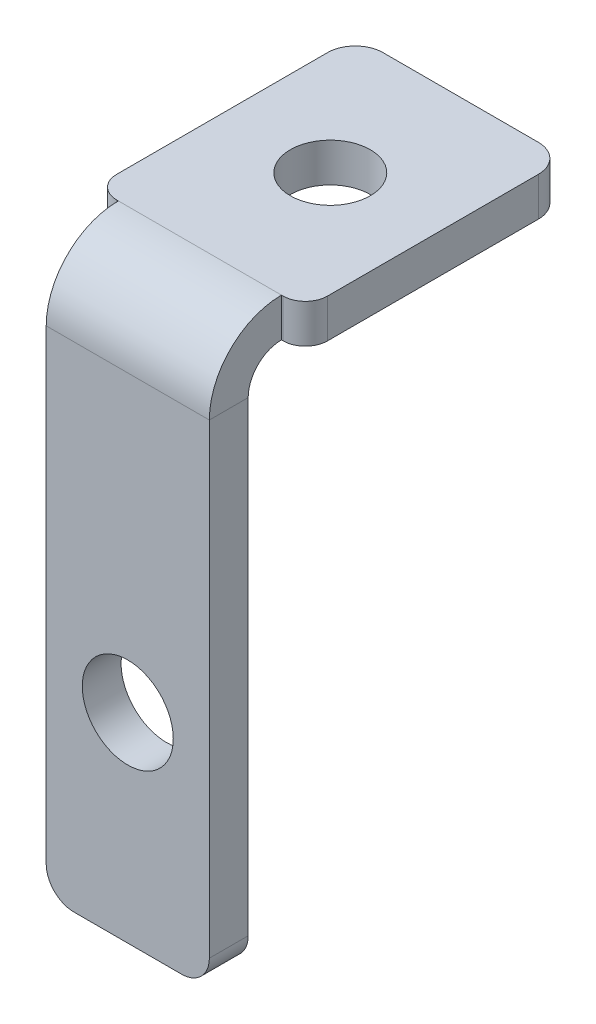
ISO-10303-21;
HEADER;
FILE_DESCRIPTION(('STEP AP214'),'2;1');
FILE_NAME('part.step','',(''),(''),'','','');
FILE_SCHEMA(('AUTOMOTIVE_DESIGN { 1 0 10303 214 1 1 1 1 }'));
ENDSEC;
DATA;
#1=APPLICATION_CONTEXT('core data for automotive mechanical design processes');
#2=APPLICATION_PROTOCOL_DEFINITION('international standard','automotive_design',2000,#1);
#3=PRODUCT_CONTEXT('',#1,'mechanical');
#4=PRODUCT('Part','Part','',(#3));
#5=PRODUCT_RELATED_PRODUCT_CATEGORY('part','',(#4));
#6=PRODUCT_DEFINITION_FORMATION('','',#4);
#7=PRODUCT_DEFINITION_CONTEXT('part definition',#1,'design');
#8=PRODUCT_DEFINITION('design','',#6,#7);
#9=PRODUCT_DEFINITION_SHAPE('','',#8);
#10=(LENGTH_UNIT() NAMED_UNIT(*) SI_UNIT(.MILLI.,.METRE.));
#11=(NAMED_UNIT(*) PLANE_ANGLE_UNIT() SI_UNIT($,.RADIAN.));
#12=(NAMED_UNIT(*) SI_UNIT($,.STERADIAN.) SOLID_ANGLE_UNIT());
#13=UNCERTAINTY_MEASURE_WITH_UNIT(LENGTH_MEASURE(1.E-05),#10,'distance_accuracy_value','');
#14=(GEOMETRIC_REPRESENTATION_CONTEXT(3) GLOBAL_UNCERTAINTY_ASSIGNED_CONTEXT((#13)) GLOBAL_UNIT_ASSIGNED_CONTEXT((#10,
#11,#12)) REPRESENTATION_CONTEXT('',''));
#15=CARTESIAN_POINT('',(0.,0.,0.));
#16=DIRECTION('',(0.,0.,1.));
#17=DIRECTION('',(1.,0.,0.));
#18=AXIS2_PLACEMENT_3D('',#15,#16,#17);
#19=CARTESIAN_POINT('',(7.35,-22.25,-3.5));
#20=DIRECTION('',(1.,0.,0.));
#21=DIRECTION('',(0.,0.,-1.));
#22=AXIS2_PLACEMENT_3D('',#19,#20,#21);
#23=PLANE('',#22);
#24=DIRECTION('',(0.,1.,0.));
#25=VECTOR('',#24,1.);
#26=CARTESIAN_POINT('',(7.35,-22.25,0.));
#27=LINE('',#26,#25);
#28=CARTESIAN_POINT('',(7.35,-19.75,0.));
#29=VERTEX_POINT('',#28);
#30=CARTESIAN_POINT('',(7.35,22.25,0.));
#31=VERTEX_POINT('',#30);
#32=EDGE_CURVE('E183',#29,#31,#27,.T.);
#33=ORIENTED_EDGE('',*,*,#32,.F.);
#34=DIRECTION('',(0.,0.,1.));
#35=VECTOR('',#34,1.);
#36=CARTESIAN_POINT('',(7.35,-19.75,-3.5));
#37=LINE('',#36,#35);
#38=CARTESIAN_POINT('',(7.35,-19.75,-3.5));
#39=VERTEX_POINT('',#38);
#40=EDGE_CURVE('E224',#29,#39,#37,.F.);
#41=ORIENTED_EDGE('',*,*,#40,.T.);
#42=DIRECTION('',(0.,1.,0.));
#43=VECTOR('',#42,1.);
#44=CARTESIAN_POINT('',(7.35,-22.25,-3.5));
#45=LINE('',#44,#43);
#46=CARTESIAN_POINT('',(7.35,22.25,-3.5));
#47=VERTEX_POINT('',#46);
#48=EDGE_CURVE('E184',#39,#47,#45,.T.);
#49=ORIENTED_EDGE('',*,*,#48,.T.);
#50=DIRECTION('',(0.,0.,1.));
#51=VECTOR('',#50,1.);
#52=CARTESIAN_POINT('',(7.35,22.25,-3.5));
#53=LINE('',#52,#51);
#54=EDGE_CURVE('E197',#47,#31,#53,.T.);
#55=ORIENTED_EDGE('',*,*,#54,.T.);
#56=EDGE_LOOP('',(#33,#41,#49,#55));
#57=FACE_BOUND('',#56,.T.);
#58=ADVANCED_FACE('F16',(#57),#23,.T.);
#59=CARTESIAN_POINT('',(-7.35,-22.25,-3.5));
#60=DIRECTION('',(0.,-1.,0.));
#61=DIRECTION('',(0.,0.,-1.));
#62=AXIS2_PLACEMENT_3D('',#59,#60,#61);
#63=PLANE('',#62);
#64=DIRECTION('',(1.,0.,0.));
#65=VECTOR('',#64,1.);
#66=CARTESIAN_POINT('',(-7.35,-22.25,-3.5));
#67=LINE('',#66,#65);
#68=CARTESIAN_POINT('',(-4.85,-22.25,-3.5));
#69=VERTEX_POINT('',#68);
#70=CARTESIAN_POINT('',(4.85,-22.25,-3.5));
#71=VERTEX_POINT('',#70);
#72=EDGE_CURVE('E194',#69,#71,#67,.T.);
#73=ORIENTED_EDGE('',*,*,#72,.T.);
#74=DIRECTION('',(0.,0.,1.));
#75=VECTOR('',#74,1.);
#76=CARTESIAN_POINT('',(4.85,-22.25,-3.5));
#77=LINE('',#76,#75);
#78=CARTESIAN_POINT('',(4.85,-22.25,0.));
#79=VERTEX_POINT('',#78);
#80=EDGE_CURVE('E217',#71,#79,#77,.T.);
#81=ORIENTED_EDGE('',*,*,#80,.T.);
#82=DIRECTION('',(1.,0.,0.));
#83=VECTOR('',#82,1.);
#84=CARTESIAN_POINT('',(-7.35,-22.25,0.));
#85=LINE('',#84,#83);
#86=CARTESIAN_POINT('',(-4.85,-22.25,0.));
#87=VERTEX_POINT('',#86);
#88=EDGE_CURVE('E188',#87,#79,#85,.T.);
#89=ORIENTED_EDGE('',*,*,#88,.F.);
#90=DIRECTION('',(0.,0.,1.));
#91=VECTOR('',#90,1.);
#92=CARTESIAN_POINT('',(-4.85,-22.25,-3.5));
#93=LINE('',#92,#91);
#94=EDGE_CURVE('E212',#87,#69,#93,.F.);
#95=ORIENTED_EDGE('',*,*,#94,.T.);
#96=EDGE_LOOP('',(#73,#81,#89,#95));
#97=FACE_BOUND('',#96,.T.);
#98=ADVANCED_FACE('F321',(#97),#63,.T.);
#99=CARTESIAN_POINT('',(-7.35,-22.25,-3.5));
#100=DIRECTION('',(-1.,0.,0.));
#101=DIRECTION('',(0.,0.,1.));
#102=AXIS2_PLACEMENT_3D('',#99,#100,#101);
#103=PLANE('',#102);
#104=DIRECTION('',(0.,-1.,0.));
#105=VECTOR('',#104,1.);
#106=CARTESIAN_POINT('',(-7.35,-22.25,-3.5));
#107=LINE('',#106,#105);
#108=CARTESIAN_POINT('',(-7.35,22.25,-3.5));
#109=VERTEX_POINT('',#108);
#110=CARTESIAN_POINT('',(-7.35,-19.75,-3.5));
#111=VERTEX_POINT('',#110);
#112=EDGE_CURVE('E191',#109,#111,#107,.T.);
#113=ORIENTED_EDGE('',*,*,#112,.T.);
#114=DIRECTION('',(0.,0.,1.));
#115=VECTOR('',#114,1.);
#116=CARTESIAN_POINT('',(-7.35,-19.75,-3.5));
#117=LINE('',#116,#115);
#118=CARTESIAN_POINT('',(-7.35,-19.75,0.));
#119=VERTEX_POINT('',#118);
#120=EDGE_CURVE('E230',#111,#119,#117,.T.);
#121=ORIENTED_EDGE('',*,*,#120,.T.);
#122=DIRECTION('',(0.,-1.,0.));
#123=VECTOR('',#122,1.);
#124=CARTESIAN_POINT('',(-7.35,-22.25,0.));
#125=LINE('',#124,#123);
#126=CARTESIAN_POINT('',(-7.35,22.25,0.));
#127=VERTEX_POINT('',#126);
#128=EDGE_CURVE('E204',#127,#119,#125,.T.);
#129=ORIENTED_EDGE('',*,*,#128,.F.);
#130=DIRECTION('',(0.,0.,1.));
#131=VECTOR('',#130,1.);
#132=CARTESIAN_POINT('',(-7.35,22.25,-3.5));
#133=LINE('',#132,#131);
#134=EDGE_CURVE('E137',#109,#127,#133,.T.);
#135=ORIENTED_EDGE('',*,*,#134,.F.);
#136=EDGE_LOOP('',(#113,#121,#129,#135));
#137=FACE_BOUND('',#136,.T.);
#138=ADVANCED_FACE('F327',(#137),#103,.T.);
#139=CARTESIAN_POINT('',(0.,0.,-3.5));
#140=DIRECTION('',(0.,0.,-1.));
#141=DIRECTION('',(-1.,0.,0.));
#142=AXIS2_PLACEMENT_3D('',#139,#140,#141);
#143=PLANE('',#142);
#144=CARTESIAN_POINT('',(0.,-4.24999999998055,-3.5));
#145=DIRECTION('',(0.,0.,1.));
#146=DIRECTION('',(1.,0.,0.));
#147=AXIS2_PLACEMENT_3D('',#144,#145,#146);
#148=CIRCLE('',#147,4.09999999999435);
#149=CARTESIAN_POINT('',(4.09999999999435,-4.24999999998055,-3.5));
#150=VERTEX_POINT('',#149);
#151=EDGE_CURVE('E370',#150,#150,#148,.T.);
#152=ORIENTED_EDGE('',*,*,#151,.T.);
#153=EDGE_LOOP('',(#152));
#154=FACE_BOUND('',#153,.T.);
#155=ORIENTED_EDGE('',*,*,#48,.F.);
#156=CARTESIAN_POINT('',(4.85,-19.75,-3.5));
#157=DIRECTION('',(0.,0.,-1.));
#158=DIRECTION('',(-1.,0.,0.));
#159=AXIS2_PLACEMENT_3D('',#156,#157,#158);
#160=CIRCLE('',#159,2.5);
#161=EDGE_CURVE('E228',#39,#71,#160,.T.);
#162=ORIENTED_EDGE('',*,*,#161,.T.);
#163=ORIENTED_EDGE('',*,*,#72,.F.);
#164=CARTESIAN_POINT('',(-4.85,-19.75,-3.5));
#165=DIRECTION('',(0.,0.,-1.));
#166=DIRECTION('',(-1.,0.,0.));
#167=AXIS2_PLACEMENT_3D('',#164,#165,#166);
#168=CIRCLE('',#167,2.5);
#169=EDGE_CURVE('E226',#69,#111,#168,.T.);
#170=ORIENTED_EDGE('',*,*,#169,.T.);
#171=ORIENTED_EDGE('',*,*,#112,.F.);
#172=DIRECTION('',(-1.,0.,0.));
#173=VECTOR('',#172,1.);
#174=CARTESIAN_POINT('',(-7.35,22.25,-3.5));
#175=LINE('',#174,#173);
#176=EDGE_CURVE('E187',#47,#109,#175,.T.);
#177=ORIENTED_EDGE('',*,*,#176,.F.);
#178=EDGE_LOOP('',(#155,#162,#163,#170,#171,#177));
#179=FACE_BOUND('',#178,.T.);
#180=ADVANCED_FACE('F348',(#154,#179),#143,.T.);
#181=CARTESIAN_POINT('',(0.,0.,0.));
#182=DIRECTION('',(0.,0.,-1.));
#183=DIRECTION('',(-1.,0.,0.));
#184=AXIS2_PLACEMENT_3D('',#181,#182,#183);
#185=PLANE('',#184);
#186=CARTESIAN_POINT('',(0.,-4.24999999998055,0.));
#187=DIRECTION('',(0.,0.,1.));
#188=DIRECTION('',(1.,0.,0.));
#189=AXIS2_PLACEMENT_3D('',#186,#187,#188);
#190=CIRCLE('',#189,4.09999999999435);
#191=CARTESIAN_POINT('',(4.09999999999435,-4.24999999998055,0.));
#192=VERTEX_POINT('',#191);
#193=EDGE_CURVE('E280',#192,#192,#190,.T.);
#194=ORIENTED_EDGE('',*,*,#193,.F.);
#195=EDGE_LOOP('',(#194));
#196=FACE_BOUND('',#195,.T.);
#197=ORIENTED_EDGE('',*,*,#88,.T.);
#198=CARTESIAN_POINT('',(4.85,-19.75,0.));
#199=DIRECTION('',(0.,0.,-1.));
#200=DIRECTION('',(-1.,0.,0.));
#201=AXIS2_PLACEMENT_3D('',#198,#199,#200);
#202=CIRCLE('',#201,2.5);
#203=EDGE_CURVE('E222',#79,#29,#202,.F.);
#204=ORIENTED_EDGE('',*,*,#203,.T.);
#205=ORIENTED_EDGE('',*,*,#32,.T.);
#206=DIRECTION('',(-1.,0.,0.));
#207=VECTOR('',#206,1.);
#208=CARTESIAN_POINT('',(-7.35,22.25,0.));
#209=LINE('',#208,#207);
#210=EDGE_CURVE('E200',#31,#127,#209,.T.);
#211=ORIENTED_EDGE('',*,*,#210,.T.);
#212=ORIENTED_EDGE('',*,*,#128,.T.);
#213=CARTESIAN_POINT('',(-4.85,-19.75,0.));
#214=DIRECTION('',(0.,0.,-1.));
#215=DIRECTION('',(-1.,0.,0.));
#216=AXIS2_PLACEMENT_3D('',#213,#214,#215);
#217=CIRCLE('',#216,2.5);
#218=EDGE_CURVE('E220',#119,#87,#217,.F.);
#219=ORIENTED_EDGE('',*,*,#218,.T.);
#220=EDGE_LOOP('',(#197,#204,#205,#211,#212,#219));
#221=FACE_BOUND('',#220,.T.);
#222=ADVANCED_FACE('F352',(#196,#221),#185,.F.);
#223=CARTESIAN_POINT('',(-7.35,22.25,-6.5));
#224=DIRECTION('',(-1.,0.,0.));
#225=DIRECTION('',(0.,0.,1.));
#226=AXIS2_PLACEMENT_3D('',#223,#224,#225);
#227=PLANE('',#226);
#228=DIRECTION('',(0.,1.,0.));
#229=VECTOR('',#228,1.);
#230=CARTESIAN_POINT('',(-7.35,25.25,-6.49999999999998));
#231=LINE('',#230,#229);
#232=CARTESIAN_POINT('',(-7.35,25.25,-6.49999999999998));
#233=VERTEX_POINT('',#232);
#234=CARTESIAN_POINT('',(-7.35,28.75,-6.49999999999997));
#235=VERTEX_POINT('',#234);
#236=EDGE_CURVE('E134',#233,#235,#231,.T.);
#237=ORIENTED_EDGE('',*,*,#236,.F.);
#238=CARTESIAN_POINT('',(-7.35,22.25,-6.5));
#239=DIRECTION('',(1.,0.,0.));
#240=DIRECTION('',(0.,0.,-1.));
#241=AXIS2_PLACEMENT_3D('',#238,#239,#240);
#242=CIRCLE('',#241,3.);
#243=EDGE_CURVE('E152',#109,#233,#242,.F.);
#244=ORIENTED_EDGE('',*,*,#243,.F.);
#245=ORIENTED_EDGE('',*,*,#134,.T.);
#246=CARTESIAN_POINT('',(-7.35,22.25,-6.5));
#247=DIRECTION('',(1.,0.,0.));
#248=DIRECTION('',(0.,0.,-1.));
#249=AXIS2_PLACEMENT_3D('',#246,#247,#248);
#250=CIRCLE('',#249,6.5);
#251=EDGE_CURVE('E129',#127,#235,#250,.F.);
#252=ORIENTED_EDGE('',*,*,#251,.T.);
#253=EDGE_LOOP('',(#237,#244,#245,#252));
#254=FACE_BOUND('',#253,.T.);
#255=ADVANCED_FACE('F131',(#254),#227,.T.);
#256=CARTESIAN_POINT('',(7.35,22.25,-6.5));
#257=DIRECTION('',(-1.,0.,0.));
#258=DIRECTION('',(0.,0.,1.));
#259=AXIS2_PLACEMENT_3D('',#256,#257,#258);
#260=PLANE('',#259);
#261=CARTESIAN_POINT('',(7.35,22.25,-6.5));
#262=DIRECTION('',(1.,0.,0.));
#263=DIRECTION('',(0.,0.,-1.));
#264=AXIS2_PLACEMENT_3D('',#261,#262,#263);
#265=CIRCLE('',#264,3.);
#266=CARTESIAN_POINT('',(7.35,25.25,-6.49999999999998));
#267=VERTEX_POINT('',#266);
#268=EDGE_CURVE('E174',#267,#47,#265,.T.);
#269=ORIENTED_EDGE('',*,*,#268,.F.);
#270=DIRECTION('',(0.,1.,0.));
#271=VECTOR('',#270,1.);
#272=CARTESIAN_POINT('',(7.35,25.25,-6.49999999999998));
#273=LINE('',#272,#271);
#274=CARTESIAN_POINT('',(7.35,28.75,-6.49999999999997));
#275=VERTEX_POINT('',#274);
#276=EDGE_CURVE('E157',#267,#275,#273,.T.);
#277=ORIENTED_EDGE('',*,*,#276,.T.);
#278=CARTESIAN_POINT('',(7.35,22.25,-6.5));
#279=DIRECTION('',(1.,0.,0.));
#280=DIRECTION('',(0.,0.,-1.));
#281=AXIS2_PLACEMENT_3D('',#278,#279,#280);
#282=CIRCLE('',#281,6.5);
#283=EDGE_CURVE('E141',#275,#31,#282,.T.);
#284=ORIENTED_EDGE('',*,*,#283,.T.);
#285=ORIENTED_EDGE('',*,*,#54,.F.);
#286=EDGE_LOOP('',(#269,#277,#284,#285));
#287=FACE_BOUND('',#286,.T.);
#288=ADVANCED_FACE('F356',(#287),#260,.F.);
#289=CARTESIAN_POINT('',(7.35,22.25,-6.5));
#290=DIRECTION('',(1.,0.,0.));
#291=DIRECTION('',(0.,1.,0.));
#292=AXIS2_PLACEMENT_3D('',#289,#290,#291);
#293=CYLINDRICAL_SURFACE('',#292,6.5);
#294=ORIENTED_EDGE('',*,*,#210,.F.);
#295=ORIENTED_EDGE('',*,*,#283,.F.);
#296=DIRECTION('',(1.,0.,0.));
#297=VECTOR('',#296,1.);
#298=CARTESIAN_POINT('',(7.35,28.75,-6.49999999999997));
#299=LINE('',#298,#297);
#300=EDGE_CURVE('E145',#235,#275,#299,.T.);
#301=ORIENTED_EDGE('',*,*,#300,.F.);
#302=ORIENTED_EDGE('',*,*,#251,.F.);
#303=EDGE_LOOP('',(#294,#295,#301,#302));
#304=FACE_BOUND('',#303,.T.);
#305=ADVANCED_FACE('F146',(#304),#293,.T.);
#306=CARTESIAN_POINT('',(7.35,22.25,-6.5));
#307=DIRECTION('',(1.,0.,0.));
#308=DIRECTION('',(0.,1.,0.));
#309=AXIS2_PLACEMENT_3D('',#306,#307,#308);
#310=CYLINDRICAL_SURFACE('',#309,3.);
#311=ORIENTED_EDGE('',*,*,#176,.T.);
#312=ORIENTED_EDGE('',*,*,#243,.T.);
#313=DIRECTION('',(1.,0.,0.));
#314=VECTOR('',#313,1.);
#315=CARTESIAN_POINT('',(7.35,25.25,-6.49999999999998));
#316=LINE('',#315,#314);
#317=EDGE_CURVE('E177',#233,#267,#316,.T.);
#318=ORIENTED_EDGE('',*,*,#317,.T.);
#319=ORIENTED_EDGE('',*,*,#268,.T.);
#320=EDGE_LOOP('',(#311,#312,#318,#319));
#321=FACE_BOUND('',#320,.T.);
#322=ADVANCED_FACE('F363',(#321),#310,.F.);
#323=CARTESIAN_POINT('',(-9.5,25.25,-6.49999999999998));
#324=DIRECTION('',(0.,0.,1.));
#325=DIRECTION('',(0.,-1.,0.));
#326=AXIS2_PLACEMENT_3D('',#323,#324,#325);
#327=PLANE('',#326);
#328=DIRECTION('',(1.,0.,0.));
#329=VECTOR('',#328,1.);
#330=CARTESIAN_POINT('',(-9.5,25.25,-6.49999999999998));
#331=LINE('',#330,#329);
#332=CARTESIAN_POINT('',(7.5,25.25,-6.49999999999998));
#333=VERTEX_POINT('',#332);
#334=EDGE_CURVE('E166',#267,#333,#331,.T.);
#335=ORIENTED_EDGE('',*,*,#334,.T.);
#336=DIRECTION('',(0.,1.,0.));
#337=VECTOR('',#336,1.);
#338=CARTESIAN_POINT('',(7.5,28.75,-6.49999999999997));
#339=LINE('',#338,#337);
#340=CARTESIAN_POINT('',(7.5,28.75,-6.49999999999997));
#341=VERTEX_POINT('',#340);
#342=EDGE_CURVE('E254',#333,#341,#339,.T.);
#343=ORIENTED_EDGE('',*,*,#342,.T.);
#344=DIRECTION('',(1.,0.,0.));
#345=VECTOR('',#344,1.);
#346=CARTESIAN_POINT('',(-9.5,28.75,-6.49999999999997));
#347=LINE('',#346,#345);
#348=EDGE_CURVE('E162',#341,#275,#347,.F.);
#349=ORIENTED_EDGE('',*,*,#348,.T.);
#350=ORIENTED_EDGE('',*,*,#276,.F.);
#351=EDGE_LOOP('',(#335,#343,#349,#350));
#352=FACE_BOUND('',#351,.T.);
#353=ADVANCED_FACE('F368',(#352),#327,.T.);
#354=CARTESIAN_POINT('',(9.5,28.7500000000001,-30.));
#355=DIRECTION('',(-1.,0.,0.));
#356=DIRECTION('',(0.,0.,1.));
#357=AXIS2_PLACEMENT_3D('',#354,#355,#356);
#358=PLANE('',#357);
#359=DIRECTION('',(0.,0.,-1.));
#360=VECTOR('',#359,1.);
#361=CARTESIAN_POINT('',(9.5,28.75,0.));
#362=LINE('',#361,#360);
#363=CARTESIAN_POINT('',(9.5,28.75,-8.49999999999997));
#364=VERTEX_POINT('',#363);
#365=CARTESIAN_POINT('',(9.5,28.7500000000001,-27.5));
#366=VERTEX_POINT('',#365);
#367=EDGE_CURVE('E277',#364,#366,#362,.T.);
#368=ORIENTED_EDGE('',*,*,#367,.F.);
#369=DIRECTION('',(0.,1.,0.));
#370=VECTOR('',#369,1.);
#371=CARTESIAN_POINT('',(9.5,25.25,-8.49999999999999));
#372=LINE('',#371,#370);
#373=CARTESIAN_POINT('',(9.5,25.25,-8.49999999999998));
#374=VERTEX_POINT('',#373);
#375=EDGE_CURVE('E260',#364,#374,#372,.F.);
#376=ORIENTED_EDGE('',*,*,#375,.T.);
#377=DIRECTION('',(0.,0.,1.));
#378=VECTOR('',#377,1.);
#379=CARTESIAN_POINT('',(9.5,25.2500000000001,-30.));
#380=LINE('',#379,#378);
#381=CARTESIAN_POINT('',(9.5,25.2500000000001,-27.5));
#382=VERTEX_POINT('',#381);
#383=EDGE_CURVE('E165',#374,#382,#380,.F.);
#384=ORIENTED_EDGE('',*,*,#383,.T.);
#385=DIRECTION('',(0.,-1.,0.));
#386=VECTOR('',#385,1.);
#387=CARTESIAN_POINT('',(9.5,28.7500000000001,-27.5));
#388=LINE('',#387,#386);
#389=EDGE_CURVE('E243',#382,#366,#388,.F.);
#390=ORIENTED_EDGE('',*,*,#389,.T.);
#391=EDGE_LOOP('',(#368,#376,#384,#390));
#392=FACE_BOUND('',#391,.T.);
#393=ADVANCED_FACE('F294',(#392),#358,.F.);
#394=CARTESIAN_POINT('',(-9.5,28.75,-3.49999999999998));
#395=DIRECTION('',(1.,0.,0.));
#396=DIRECTION('',(0.,0.,-1.));
#397=AXIS2_PLACEMENT_3D('',#394,#395,#396);
#398=PLANE('',#397);
#399=DIRECTION('',(0.,0.,-1.));
#400=VECTOR('',#399,1.);
#401=CARTESIAN_POINT('',(-9.5,25.25,-3.5));
#402=LINE('',#401,#400);
#403=CARTESIAN_POINT('',(-9.5,25.2500000000001,-27.5));
#404=VERTEX_POINT('',#403);
#405=CARTESIAN_POINT('',(-9.5,25.25,-8.49999999999999));
#406=VERTEX_POINT('',#405);
#407=EDGE_CURVE('E270',#404,#406,#402,.F.);
#408=ORIENTED_EDGE('',*,*,#407,.T.);
#409=DIRECTION('',(0.,1.,0.));
#410=VECTOR('',#409,1.);
#411=CARTESIAN_POINT('',(-9.5,28.75,-8.49999999999997));
#412=LINE('',#411,#410);
#413=CARTESIAN_POINT('',(-9.5,28.75,-8.49999999999997));
#414=VERTEX_POINT('',#413);
#415=EDGE_CURVE('E24',#406,#414,#412,.T.);
#416=ORIENTED_EDGE('',*,*,#415,.T.);
#417=DIRECTION('',(0.,0.,1.));
#418=VECTOR('',#417,1.);
#419=CARTESIAN_POINT('',(-9.5,28.75,0.));
#420=LINE('',#419,#418);
#421=CARTESIAN_POINT('',(-9.5,28.7500000000001,-27.5));
#422=VERTEX_POINT('',#421);
#423=EDGE_CURVE('E179',#422,#414,#420,.T.);
#424=ORIENTED_EDGE('',*,*,#423,.F.);
#425=DIRECTION('',(0.,-1.,0.));
#426=VECTOR('',#425,1.);
#427=CARTESIAN_POINT('',(-9.5,28.7500000000001,-27.5));
#428=LINE('',#427,#426);
#429=EDGE_CURVE('E251',#422,#404,#428,.T.);
#430=ORIENTED_EDGE('',*,*,#429,.T.);
#431=EDGE_LOOP('',(#408,#416,#424,#430));
#432=FACE_BOUND('',#431,.T.);
#433=ADVANCED_FACE('F268',(#432),#398,.F.);
#434=CARTESIAN_POINT('',(0.,28.75,0.));
#435=DIRECTION('',(0.,-1.,0.));
#436=DIRECTION('',(0.,0.,-1.));
#437=AXIS2_PLACEMENT_3D('',#434,#435,#436);
#438=PLANE('',#437);
#439=CARTESIAN_POINT('',(0.,28.75,-18.25));
#440=DIRECTION('',(0.,1.,0.));
#441=DIRECTION('',(0.,0.,1.));
#442=AXIS2_PLACEMENT_3D('',#439,#440,#441);
#443=CIRCLE('',#442,3.6);
#444=CARTESIAN_POINT('',(0.,28.75,-14.65));
#445=VERTEX_POINT('',#444);
#446=EDGE_CURVE('E381',#445,#445,#443,.T.);
#447=ORIENTED_EDGE('',*,*,#446,.F.);
#448=EDGE_LOOP('',(#447));
#449=FACE_BOUND('',#448,.T.);
#450=ORIENTED_EDGE('',*,*,#348,.F.);
#451=CARTESIAN_POINT('',(7.5,28.75,-8.49999999999997));
#452=DIRECTION('',(0.,-1.,0.));
#453=DIRECTION('',(0.,0.,-1.));
#454=AXIS2_PLACEMENT_3D('',#451,#452,#453);
#455=CIRCLE('',#454,2.);
#456=EDGE_CURVE('E258',#341,#364,#455,.F.);
#457=ORIENTED_EDGE('',*,*,#456,.T.);
#458=ORIENTED_EDGE('',*,*,#367,.T.);
#459=CARTESIAN_POINT('',(7.,28.7500000000001,-27.5));
#460=DIRECTION('',(0.,-1.,0.));
#461=DIRECTION('',(0.,0.,-1.));
#462=AXIS2_PLACEMENT_3D('',#459,#460,#461);
#463=CIRCLE('',#462,2.5);
#464=CARTESIAN_POINT('',(7.,28.7500000000001,-30.));
#465=VERTEX_POINT('',#464);
#466=EDGE_CURVE('E249',#366,#465,#463,.F.);
#467=ORIENTED_EDGE('',*,*,#466,.T.);
#468=DIRECTION('',(-1.,0.,0.));
#469=VECTOR('',#468,1.);
#470=CARTESIAN_POINT('',(0.,28.7500000000001,-30.));
#471=LINE('',#470,#469);
#472=CARTESIAN_POINT('',(-7.,28.7500000000001,-30.));
#473=VERTEX_POINT('',#472);
#474=EDGE_CURVE('E274',#465,#473,#471,.T.);
#475=ORIENTED_EDGE('',*,*,#474,.T.);
#476=CARTESIAN_POINT('',(-7.,28.7500000000001,-27.5));
#477=DIRECTION('',(0.,-1.,0.));
#478=DIRECTION('',(0.,0.,-1.));
#479=AXIS2_PLACEMENT_3D('',#476,#477,#478);
#480=CIRCLE('',#479,2.5);
#481=EDGE_CURVE('E246',#473,#422,#480,.F.);
#482=ORIENTED_EDGE('',*,*,#481,.T.);
#483=ORIENTED_EDGE('',*,*,#423,.T.);
#484=CARTESIAN_POINT('',(-7.5,28.75,-8.49999999999997));
#485=DIRECTION('',(0.,-1.,0.));
#486=DIRECTION('',(0.,0.,-1.));
#487=AXIS2_PLACEMENT_3D('',#484,#485,#486);
#488=CIRCLE('',#487,2.);
#489=CARTESIAN_POINT('',(-7.5,28.75,-6.49999999999997));
#490=VERTEX_POINT('',#489);
#491=EDGE_CURVE('E161',#414,#490,#488,.F.);
#492=ORIENTED_EDGE('',*,*,#491,.T.);
#493=EDGE_CURVE('E155',#235,#490,#347,.F.);
#494=ORIENTED_EDGE('',*,*,#493,.F.);
#495=ORIENTED_EDGE('',*,*,#300,.T.);
#496=EDGE_LOOP('',(#450,#457,#458,#467,#475,#482,#483,#492,#494,#495));
#497=FACE_BOUND('',#496,.T.);
#498=ADVANCED_FACE('F159',(#449,#497),#438,.F.);
#499=CARTESIAN_POINT('',(0.,25.25,0.));
#500=DIRECTION('',(0.,-1.,0.));
#501=DIRECTION('',(0.,0.,-1.));
#502=AXIS2_PLACEMENT_3D('',#499,#500,#501);
#503=PLANE('',#502);
#504=CARTESIAN_POINT('',(0.,25.25,-18.25));
#505=DIRECTION('',(0.,1.,0.));
#506=DIRECTION('',(0.,0.,1.));
#507=AXIS2_PLACEMENT_3D('',#504,#505,#506);
#508=CIRCLE('',#507,3.6);
#509=CARTESIAN_POINT('',(0.,25.25,-14.65));
#510=VERTEX_POINT('',#509);
#511=EDGE_CURVE('E379',#510,#510,#508,.T.);
#512=ORIENTED_EDGE('',*,*,#511,.T.);
#513=EDGE_LOOP('',(#512));
#514=FACE_BOUND('',#513,.T.);
#515=ORIENTED_EDGE('',*,*,#383,.F.);
#516=CARTESIAN_POINT('',(7.5,25.25,-8.49999999999999));
#517=DIRECTION('',(0.,-1.,0.));
#518=DIRECTION('',(0.,0.,-1.));
#519=AXIS2_PLACEMENT_3D('',#516,#517,#518);
#520=CIRCLE('',#519,2.);
#521=EDGE_CURVE('E263',#374,#333,#520,.T.);
#522=ORIENTED_EDGE('',*,*,#521,.T.);
#523=ORIENTED_EDGE('',*,*,#334,.F.);
#524=ORIENTED_EDGE('',*,*,#317,.F.);
#525=CARTESIAN_POINT('',(-7.5,25.25,-6.49999999999998));
#526=VERTEX_POINT('',#525);
#527=EDGE_CURVE('E156',#526,#233,#331,.T.);
#528=ORIENTED_EDGE('',*,*,#527,.F.);
#529=CARTESIAN_POINT('',(-7.5,25.25,-8.49999999999999));
#530=DIRECTION('',(0.,-1.,0.));
#531=DIRECTION('',(0.,0.,-1.));
#532=AXIS2_PLACEMENT_3D('',#529,#530,#531);
#533=CIRCLE('',#532,2.);
#534=EDGE_CURVE('E31',#526,#406,#533,.T.);
#535=ORIENTED_EDGE('',*,*,#534,.T.);
#536=ORIENTED_EDGE('',*,*,#407,.F.);
#537=CARTESIAN_POINT('',(-7.,25.2500000000001,-27.5));
#538=DIRECTION('',(0.,-1.,0.));
#539=DIRECTION('',(0.,0.,-1.));
#540=AXIS2_PLACEMENT_3D('',#537,#538,#539);
#541=CIRCLE('',#540,2.5);
#542=CARTESIAN_POINT('',(-7.,25.2500000000001,-30.));
#543=VERTEX_POINT('',#542);
#544=EDGE_CURVE('E238',#404,#543,#541,.T.);
#545=ORIENTED_EDGE('',*,*,#544,.T.);
#546=DIRECTION('',(1.,0.,0.));
#547=VECTOR('',#546,1.);
#548=CARTESIAN_POINT('',(-9.5,25.2500000000001,-30.));
#549=LINE('',#548,#547);
#550=CARTESIAN_POINT('',(7.,25.2500000000001,-30.));
#551=VERTEX_POINT('',#550);
#552=EDGE_CURVE('E286',#551,#543,#549,.F.);
#553=ORIENTED_EDGE('',*,*,#552,.F.);
#554=CARTESIAN_POINT('',(7.,25.2500000000001,-27.5));
#555=DIRECTION('',(0.,-1.,0.));
#556=DIRECTION('',(0.,0.,-1.));
#557=AXIS2_PLACEMENT_3D('',#554,#555,#556);
#558=CIRCLE('',#557,2.5);
#559=EDGE_CURVE('E240',#551,#382,#558,.T.);
#560=ORIENTED_EDGE('',*,*,#559,.T.);
#561=EDGE_LOOP('',(#515,#522,#523,#524,#528,#535,#536,#545,#553,#560));
#562=FACE_BOUND('',#561,.T.);
#563=ADVANCED_FACE('F299',(#514,#562),#503,.T.);
#564=CARTESIAN_POINT('',(-9.5,28.7500000000001,-30.));
#565=DIRECTION('',(0.,0.,1.));
#566=DIRECTION('',(0.,-1.,0.));
#567=AXIS2_PLACEMENT_3D('',#564,#565,#566);
#568=PLANE('',#567);
#569=ORIENTED_EDGE('',*,*,#474,.F.);
#570=DIRECTION('',(0.,-1.,0.));
#571=VECTOR('',#570,1.);
#572=CARTESIAN_POINT('',(7.,28.7500000000001,-30.));
#573=LINE('',#572,#571);
#574=EDGE_CURVE('E235',#465,#551,#573,.T.);
#575=ORIENTED_EDGE('',*,*,#574,.T.);
#576=ORIENTED_EDGE('',*,*,#552,.T.);
#577=DIRECTION('',(0.,-1.,0.));
#578=VECTOR('',#577,1.);
#579=CARTESIAN_POINT('',(-7.,28.7500000000001,-30.));
#580=LINE('',#579,#578);
#581=EDGE_CURVE('E233',#543,#473,#580,.F.);
#582=ORIENTED_EDGE('',*,*,#581,.T.);
#583=EDGE_LOOP('',(#569,#575,#576,#582));
#584=FACE_BOUND('',#583,.T.);
#585=ADVANCED_FACE('F304',(#584),#568,.F.);
#586=ORIENTED_EDGE('',*,*,#493,.T.);
#587=DIRECTION('',(0.,1.,0.));
#588=VECTOR('',#587,1.);
#589=CARTESIAN_POINT('',(-7.5,25.25,-6.49999999999998));
#590=LINE('',#589,#588);
#591=EDGE_CURVE('E10',#490,#526,#590,.F.);
#592=ORIENTED_EDGE('',*,*,#591,.T.);
#593=ORIENTED_EDGE('',*,*,#527,.T.);
#594=ORIENTED_EDGE('',*,*,#236,.T.);
#595=EDGE_LOOP('',(#586,#592,#593,#594));
#596=FACE_BOUND('',#595,.T.);
#597=ADVANCED_FACE('F154',(#596),#327,.T.);
#598=CARTESIAN_POINT('',(4.85,-19.75,-3.5));
#599=DIRECTION('',(0.,0.,1.));
#600=DIRECTION('',(1.,0.,0.));
#601=AXIS2_PLACEMENT_3D('',#598,#599,#600);
#602=CYLINDRICAL_SURFACE('',#601,2.5);
#603=ORIENTED_EDGE('',*,*,#161,.F.);
#604=ORIENTED_EDGE('',*,*,#40,.F.);
#605=ORIENTED_EDGE('',*,*,#203,.F.);
#606=ORIENTED_EDGE('',*,*,#80,.F.);
#607=EDGE_LOOP('',(#603,#604,#605,#606));
#608=FACE_BOUND('',#607,.T.);
#609=ADVANCED_FACE('F333',(#608),#602,.T.);
#610=CARTESIAN_POINT('',(-4.85,-19.75,-3.5));
#611=DIRECTION('',(0.,0.,1.));
#612=DIRECTION('',(1.,0.,0.));
#613=AXIS2_PLACEMENT_3D('',#610,#611,#612);
#614=CYLINDRICAL_SURFACE('',#613,2.5);
#615=ORIENTED_EDGE('',*,*,#169,.F.);
#616=ORIENTED_EDGE('',*,*,#94,.F.);
#617=ORIENTED_EDGE('',*,*,#218,.F.);
#618=ORIENTED_EDGE('',*,*,#120,.F.);
#619=EDGE_LOOP('',(#615,#616,#617,#618));
#620=FACE_BOUND('',#619,.T.);
#621=ADVANCED_FACE('F318',(#620),#614,.T.);
#622=CARTESIAN_POINT('',(7.,28.7500000000001,-27.5));
#623=DIRECTION('',(0.,-1.,0.));
#624=DIRECTION('',(0.,0.,-1.));
#625=AXIS2_PLACEMENT_3D('',#622,#623,#624);
#626=CYLINDRICAL_SURFACE('',#625,2.5);
#627=ORIENTED_EDGE('',*,*,#466,.F.);
#628=ORIENTED_EDGE('',*,*,#389,.F.);
#629=ORIENTED_EDGE('',*,*,#559,.F.);
#630=ORIENTED_EDGE('',*,*,#574,.F.);
#631=EDGE_LOOP('',(#627,#628,#629,#630));
#632=FACE_BOUND('',#631,.T.);
#633=ADVANCED_FACE('F302',(#632),#626,.T.);
#634=CARTESIAN_POINT('',(-7.,28.7500000000001,-27.5));
#635=DIRECTION('',(0.,-1.,0.));
#636=DIRECTION('',(0.,0.,-1.));
#637=AXIS2_PLACEMENT_3D('',#634,#635,#636);
#638=CYLINDRICAL_SURFACE('',#637,2.5);
#639=ORIENTED_EDGE('',*,*,#481,.F.);
#640=ORIENTED_EDGE('',*,*,#581,.F.);
#641=ORIENTED_EDGE('',*,*,#544,.F.);
#642=ORIENTED_EDGE('',*,*,#429,.F.);
#643=EDGE_LOOP('',(#639,#640,#641,#642));
#644=FACE_BOUND('',#643,.T.);
#645=ADVANCED_FACE('F306',(#644),#638,.T.);
#646=CARTESIAN_POINT('',(0.,-4.24999999998055,-3.5));
#647=DIRECTION('',(0.,0.,1.));
#648=DIRECTION('',(1.,0.,0.));
#649=AXIS2_PLACEMENT_3D('',#646,#647,#648);
#650=CYLINDRICAL_SURFACE('',#649,4.09999999999435);
#651=ORIENTED_EDGE('',*,*,#151,.F.);
#652=EDGE_LOOP('',(#651));
#653=FACE_BOUND('',#652,.T.);
#654=ORIENTED_EDGE('',*,*,#193,.T.);
#655=EDGE_LOOP('',(#654));
#656=FACE_BOUND('',#655,.T.);
#657=ADVANCED_FACE('F308',(#653,#656),#650,.F.);
#658=CARTESIAN_POINT('',(0.,25.25,-18.25));
#659=DIRECTION('',(0.,1.,0.));
#660=DIRECTION('',(0.,0.,1.));
#661=AXIS2_PLACEMENT_3D('',#658,#659,#660);
#662=CYLINDRICAL_SURFACE('',#661,3.6);
#663=ORIENTED_EDGE('',*,*,#511,.F.);
#664=EDGE_LOOP('',(#663));
#665=FACE_BOUND('',#664,.T.);
#666=ORIENTED_EDGE('',*,*,#446,.T.);
#667=EDGE_LOOP('',(#666));
#668=FACE_BOUND('',#667,.T.);
#669=ADVANCED_FACE('F315',(#665,#668),#662,.F.);
#670=CARTESIAN_POINT('',(7.5,25.25,-8.49999999999999));
#671=DIRECTION('',(0.,-1.,0.));
#672=DIRECTION('',(0.,0.,-1.));
#673=AXIS2_PLACEMENT_3D('',#670,#671,#672);
#674=CYLINDRICAL_SURFACE('',#673,2.);
#675=ORIENTED_EDGE('',*,*,#521,.F.);
#676=ORIENTED_EDGE('',*,*,#375,.F.);
#677=ORIENTED_EDGE('',*,*,#456,.F.);
#678=ORIENTED_EDGE('',*,*,#342,.F.);
#679=EDGE_LOOP('',(#675,#676,#677,#678));
#680=FACE_BOUND('',#679,.T.);
#681=ADVANCED_FACE('F393',(#680),#674,.T.);
#682=CARTESIAN_POINT('',(-7.5,28.75,-8.49999999999997));
#683=DIRECTION('',(0.,-1.,0.));
#684=DIRECTION('',(0.,0.,-1.));
#685=AXIS2_PLACEMENT_3D('',#682,#683,#684);
#686=CYLINDRICAL_SURFACE('',#685,2.);
#687=ORIENTED_EDGE('',*,*,#534,.F.);
#688=ORIENTED_EDGE('',*,*,#591,.F.);
#689=ORIENTED_EDGE('',*,*,#491,.F.);
#690=ORIENTED_EDGE('',*,*,#415,.F.);
#691=EDGE_LOOP('',(#687,#688,#689,#690));
#692=FACE_BOUND('',#691,.T.);
#693=ADVANCED_FACE('F18',(#692),#686,.T.);
#694=CLOSED_SHELL('',(#58,#98,#138,#180,#222,#255,#288,#305,#322,#353,#393,#433,#498,#563,#585,
#597,#609,#621,#633,#645,#657,#669,#681,#693));
#695=MANIFOLD_SOLID_BREP('B1',#694);
#696=ADVANCED_BREP_SHAPE_REPRESENTATION('',(#18,#695),#14);
#697=SHAPE_DEFINITION_REPRESENTATION(#9,#696);
ENDSEC;
END-ISO-10303-21;
